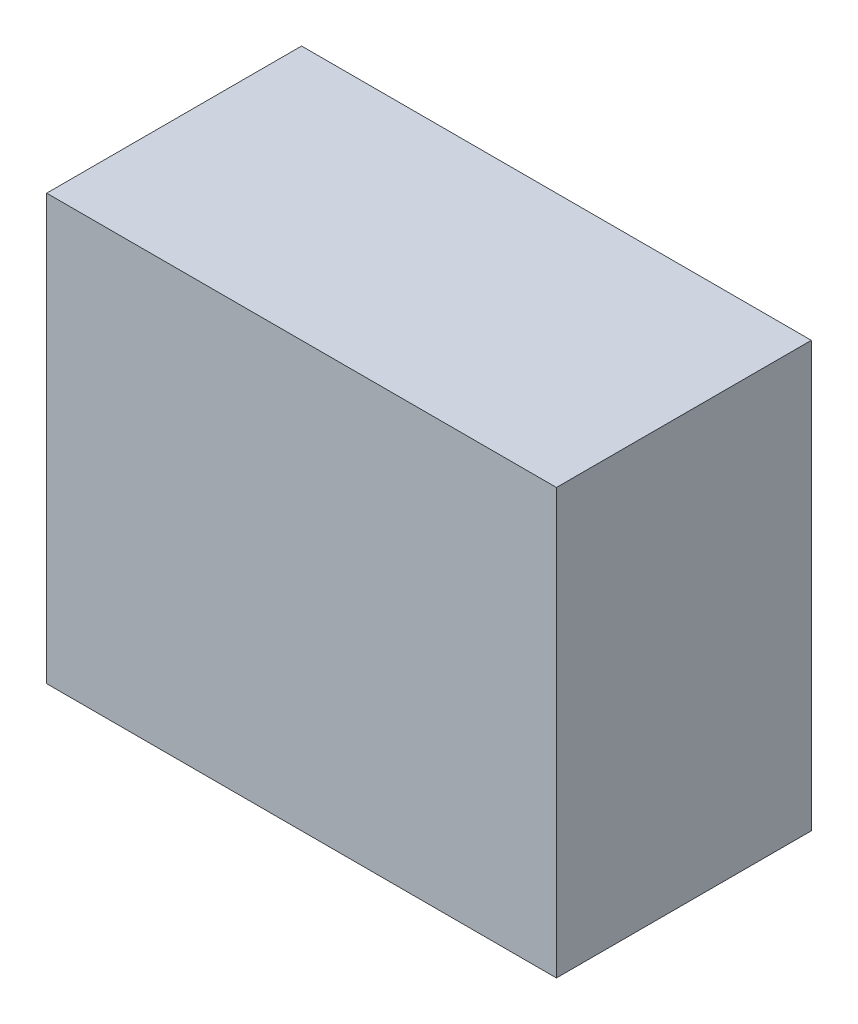
ISO-10303-21;
HEADER;
FILE_DESCRIPTION(('STEP AP214'),'2;1');
FILE_NAME('part.step','',(''),(''),'','','');
FILE_SCHEMA(('AUTOMOTIVE_DESIGN { 1 0 10303 214 1 1 1 1 }'));
ENDSEC;
DATA;
#1=APPLICATION_CONTEXT('core data for automotive mechanical design processes');
#2=APPLICATION_PROTOCOL_DEFINITION('international standard','automotive_design',2000,#1);
#3=PRODUCT_CONTEXT('',#1,'mechanical');
#4=PRODUCT('Part','Part','',(#3));
#5=PRODUCT_RELATED_PRODUCT_CATEGORY('part','',(#4));
#6=PRODUCT_DEFINITION_FORMATION('','',#4);
#7=PRODUCT_DEFINITION_CONTEXT('part definition',#1,'design');
#8=PRODUCT_DEFINITION('design','',#6,#7);
#9=PRODUCT_DEFINITION_SHAPE('','',#8);
#10=(LENGTH_UNIT() NAMED_UNIT(*) SI_UNIT(.MILLI.,.METRE.));
#11=(NAMED_UNIT(*) PLANE_ANGLE_UNIT() SI_UNIT($,.RADIAN.));
#12=(NAMED_UNIT(*) SI_UNIT($,.STERADIAN.) SOLID_ANGLE_UNIT());
#13=UNCERTAINTY_MEASURE_WITH_UNIT(LENGTH_MEASURE(1.E-05),#10,'distance_accuracy_value','');
#14=(GEOMETRIC_REPRESENTATION_CONTEXT(3) GLOBAL_UNCERTAINTY_ASSIGNED_CONTEXT((#13)) GLOBAL_UNIT_ASSIGNED_CONTEXT((#10,
#11,#12)) REPRESENTATION_CONTEXT('',''));
#15=CARTESIAN_POINT('',(0.,0.,0.));
#16=DIRECTION('',(0.,0.,1.));
#17=DIRECTION('',(1.,0.,0.));
#18=AXIS2_PLACEMENT_3D('',#15,#16,#17);
#19=CARTESIAN_POINT('',(15.,12.5,15.));
#20=DIRECTION('',(-1.,0.,0.));
#21=DIRECTION('',(0.,-1.,0.));
#22=AXIS2_PLACEMENT_3D('',#19,#20,#21);
#23=PLANE('',#22);
#24=DIRECTION('',(0.,1.,0.));
#25=VECTOR('',#24,1.);
#26=CARTESIAN_POINT('',(15.,12.5,0.));
#27=LINE('',#26,#25);
#28=CARTESIAN_POINT('',(15.,-12.5,0.));
#29=VERTEX_POINT('',#28);
#30=CARTESIAN_POINT('',(15.,12.5,0.));
#31=VERTEX_POINT('',#30);
#32=EDGE_CURVE('E110',#29,#31,#27,.T.);
#33=ORIENTED_EDGE('',*,*,#32,.T.);
#34=DIRECTION('',(0.,0.,-1.));
#35=VECTOR('',#34,1.);
#36=CARTESIAN_POINT('',(15.,12.5,15.));
#37=LINE('',#36,#35);
#38=CARTESIAN_POINT('',(15.,12.5,15.));
#39=VERTEX_POINT('',#38);
#40=EDGE_CURVE('E11',#39,#31,#37,.T.);
#41=ORIENTED_EDGE('',*,*,#40,.F.);
#42=DIRECTION('',(0.,1.,0.));
#43=VECTOR('',#42,1.);
#44=CARTESIAN_POINT('',(15.,12.5,15.));
#45=LINE('',#44,#43);
#46=CARTESIAN_POINT('',(15.,-12.5,15.));
#47=VERTEX_POINT('',#46);
#48=EDGE_CURVE('E94',#47,#39,#45,.T.);
#49=ORIENTED_EDGE('',*,*,#48,.F.);
#50=DIRECTION('',(0.,0.,-1.));
#51=VECTOR('',#50,1.);
#52=CARTESIAN_POINT('',(15.,-12.5,15.));
#53=LINE('',#52,#51);
#54=EDGE_CURVE('E106',#47,#29,#53,.T.);
#55=ORIENTED_EDGE('',*,*,#54,.T.);
#56=EDGE_LOOP('',(#33,#41,#49,#55));
#57=FACE_BOUND('',#56,.T.);
#58=ADVANCED_FACE('F42',(#57),#23,.F.);
#59=CARTESIAN_POINT('',(-15.,12.5,15.));
#60=DIRECTION('',(0.,-1.,0.));
#61=DIRECTION('',(0.,0.,-1.));
#62=AXIS2_PLACEMENT_3D('',#59,#60,#61);
#63=PLANE('',#62);
#64=DIRECTION('',(-1.,0.,0.));
#65=VECTOR('',#64,1.);
#66=CARTESIAN_POINT('',(-15.,12.5,0.));
#67=LINE('',#66,#65);
#68=CARTESIAN_POINT('',(-15.,12.5,0.));
#69=VERTEX_POINT('',#68);
#70=EDGE_CURVE('E99',#31,#69,#67,.T.);
#71=ORIENTED_EDGE('',*,*,#70,.T.);
#72=DIRECTION('',(0.,0.,-1.));
#73=VECTOR('',#72,1.);
#74=CARTESIAN_POINT('',(-15.,12.5,15.));
#75=LINE('',#74,#73);
#76=CARTESIAN_POINT('',(-15.,12.5,15.));
#77=VERTEX_POINT('',#76);
#78=EDGE_CURVE('E51',#77,#69,#75,.T.);
#79=ORIENTED_EDGE('',*,*,#78,.F.);
#80=DIRECTION('',(-1.,0.,0.));
#81=VECTOR('',#80,1.);
#82=CARTESIAN_POINT('',(-15.,12.5,15.));
#83=LINE('',#82,#81);
#84=EDGE_CURVE('E89',#39,#77,#83,.T.);
#85=ORIENTED_EDGE('',*,*,#84,.F.);
#86=ORIENTED_EDGE('',*,*,#40,.T.);
#87=EDGE_LOOP('',(#71,#79,#85,#86));
#88=FACE_BOUND('',#87,.T.);
#89=ADVANCED_FACE('F98',(#88),#63,.F.);
#90=CARTESIAN_POINT('',(-15.,12.5,15.));
#91=DIRECTION('',(1.,0.,0.));
#92=DIRECTION('',(0.,1.,0.));
#93=AXIS2_PLACEMENT_3D('',#90,#91,#92);
#94=PLANE('',#93);
#95=DIRECTION('',(0.,-1.,0.));
#96=VECTOR('',#95,1.);
#97=CARTESIAN_POINT('',(-15.,12.5,0.));
#98=LINE('',#97,#96);
#99=CARTESIAN_POINT('',(-15.,-12.5,0.));
#100=VERTEX_POINT('',#99);
#101=EDGE_CURVE('E76',#69,#100,#98,.T.);
#102=ORIENTED_EDGE('',*,*,#101,.T.);
#103=DIRECTION('',(0.,0.,-1.));
#104=VECTOR('',#103,1.);
#105=CARTESIAN_POINT('',(-15.,-12.5,15.));
#106=LINE('',#105,#104);
#107=CARTESIAN_POINT('',(-15.,-12.5,15.));
#108=VERTEX_POINT('',#107);
#109=EDGE_CURVE('E101',#108,#100,#106,.T.);
#110=ORIENTED_EDGE('',*,*,#109,.F.);
#111=DIRECTION('',(0.,-1.,0.));
#112=VECTOR('',#111,1.);
#113=CARTESIAN_POINT('',(-15.,12.5,15.));
#114=LINE('',#113,#112);
#115=EDGE_CURVE('E92',#77,#108,#114,.T.);
#116=ORIENTED_EDGE('',*,*,#115,.F.);
#117=ORIENTED_EDGE('',*,*,#78,.T.);
#118=EDGE_LOOP('',(#102,#110,#116,#117));
#119=FACE_BOUND('',#118,.T.);
#120=ADVANCED_FACE('F102',(#119),#94,.F.);
#121=CARTESIAN_POINT('',(-15.,-12.5,15.));
#122=DIRECTION('',(0.,1.,0.));
#123=DIRECTION('',(0.,0.,1.));
#124=AXIS2_PLACEMENT_3D('',#121,#122,#123);
#125=PLANE('',#124);
#126=DIRECTION('',(1.,0.,0.));
#127=VECTOR('',#126,1.);
#128=CARTESIAN_POINT('',(-15.,-12.5,0.));
#129=LINE('',#128,#127);
#130=EDGE_CURVE('E82',#100,#29,#129,.T.);
#131=ORIENTED_EDGE('',*,*,#130,.T.);
#132=ORIENTED_EDGE('',*,*,#54,.F.);
#133=DIRECTION('',(1.,0.,0.));
#134=VECTOR('',#133,1.);
#135=CARTESIAN_POINT('',(-15.,-12.5,15.));
#136=LINE('',#135,#134);
#137=EDGE_CURVE('E59',#108,#47,#136,.T.);
#138=ORIENTED_EDGE('',*,*,#137,.F.);
#139=ORIENTED_EDGE('',*,*,#109,.T.);
#140=EDGE_LOOP('',(#131,#132,#138,#139));
#141=FACE_BOUND('',#140,.T.);
#142=ADVANCED_FACE('F123',(#141),#125,.F.);
#143=CARTESIAN_POINT('',(0.,0.,15.));
#144=DIRECTION('',(0.,0.,1.));
#145=DIRECTION('',(1.,0.,0.));
#146=AXIS2_PLACEMENT_3D('',#143,#144,#145);
#147=PLANE('',#146);
#148=ORIENTED_EDGE('',*,*,#48,.T.);
#149=ORIENTED_EDGE('',*,*,#84,.T.);
#150=ORIENTED_EDGE('',*,*,#115,.T.);
#151=ORIENTED_EDGE('',*,*,#137,.T.);
#152=EDGE_LOOP('',(#148,#149,#150,#151));
#153=FACE_BOUND('',#152,.T.);
#154=ADVANCED_FACE('F90',(#153),#147,.T.);
#155=CARTESIAN_POINT('',(0.,0.,0.));
#156=DIRECTION('',(0.,0.,1.));
#157=DIRECTION('',(1.,0.,0.));
#158=AXIS2_PLACEMENT_3D('',#155,#156,#157);
#159=PLANE('',#158);
#160=ORIENTED_EDGE('',*,*,#32,.F.);
#161=ORIENTED_EDGE('',*,*,#130,.F.);
#162=ORIENTED_EDGE('',*,*,#101,.F.);
#163=ORIENTED_EDGE('',*,*,#70,.F.);
#164=EDGE_LOOP('',(#160,#161,#162,#163));
#165=FACE_BOUND('',#164,.T.);
#166=ADVANCED_FACE('F126',(#165),#159,.F.);
#167=CLOSED_SHELL('',(#58,#89,#120,#142,#154,#166));
#168=MANIFOLD_SOLID_BREP('B2',#167);
#169=ADVANCED_BREP_SHAPE_REPRESENTATION('',(#18,#168),#14);
#170=SHAPE_DEFINITION_REPRESENTATION(#9,#169);
ENDSEC;
END-ISO-10303-21;
